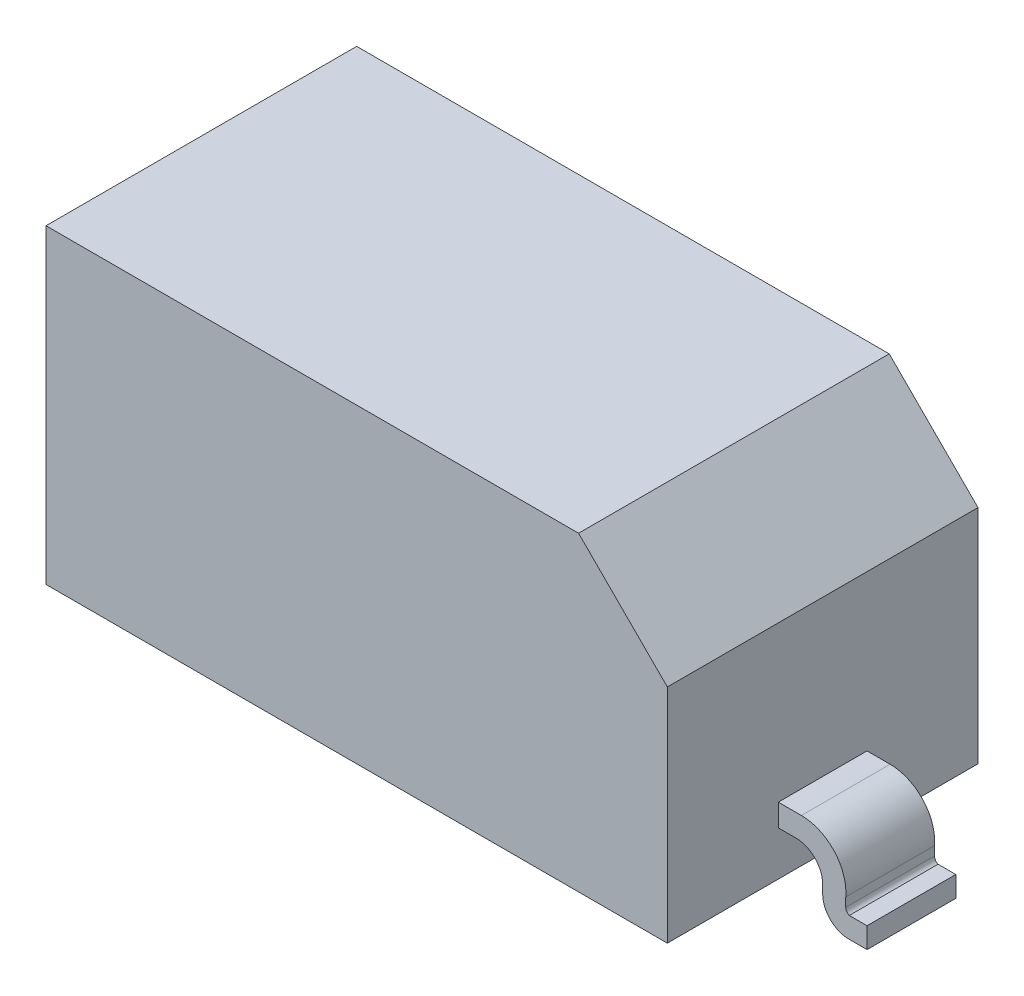
ISO-10303-21;
HEADER;
FILE_DESCRIPTION(('STEP AP214'),'2;1');
FILE_NAME('part.step','',(''),(''),'','','');
FILE_SCHEMA(('AUTOMOTIVE_DESIGN { 1 0 10303 214 1 1 1 1 }'));
ENDSEC;
DATA;
#1=APPLICATION_CONTEXT('core data for automotive mechanical design processes');
#2=APPLICATION_PROTOCOL_DEFINITION('international standard','automotive_design',2000,#1);
#3=PRODUCT_CONTEXT('',#1,'mechanical');
#4=PRODUCT('Part','Part','',(#3));
#5=PRODUCT_RELATED_PRODUCT_CATEGORY('part','',(#4));
#6=PRODUCT_DEFINITION_FORMATION('','',#4);
#7=PRODUCT_DEFINITION_CONTEXT('part definition',#1,'design');
#8=PRODUCT_DEFINITION('design','',#6,#7);
#9=PRODUCT_DEFINITION_SHAPE('','',#8);
#10=(LENGTH_UNIT() NAMED_UNIT(*) SI_UNIT(.MILLI.,.METRE.));
#11=(NAMED_UNIT(*) PLANE_ANGLE_UNIT() SI_UNIT($,.RADIAN.));
#12=(NAMED_UNIT(*) SI_UNIT($,.STERADIAN.) SOLID_ANGLE_UNIT());
#13=UNCERTAINTY_MEASURE_WITH_UNIT(LENGTH_MEASURE(1.E-05),#10,'distance_accuracy_value','');
#14=(GEOMETRIC_REPRESENTATION_CONTEXT(3) GLOBAL_UNCERTAINTY_ASSIGNED_CONTEXT((#13)) GLOBAL_UNIT_ASSIGNED_CONTEXT((#10,
#11,#12)) REPRESENTATION_CONTEXT('',''));
#15=CARTESIAN_POINT('',(0.,0.,0.));
#16=DIRECTION('',(0.,0.,1.));
#17=DIRECTION('',(1.,0.,0.));
#18=AXIS2_PLACEMENT_3D('',#15,#16,#17);
#19=CARTESIAN_POINT('',(-1.75,0.875,0.875));
#20=DIRECTION('',(1.,0.,0.));
#21=DIRECTION('',(0.,0.,-1.));
#22=AXIS2_PLACEMENT_3D('',#19,#20,#21);
#23=PLANE('',#22);
#24=DIRECTION('',(0.,-1.,0.));
#25=VECTOR('',#24,1.);
#26=CARTESIAN_POINT('',(-1.75,0.875,-0.875));
#27=LINE('',#26,#25);
#28=CARTESIAN_POINT('',(-1.75,0.875,-0.875));
#29=VERTEX_POINT('',#28);
#30=CARTESIAN_POINT('',(-1.75,-0.875,-0.875));
#31=VERTEX_POINT('',#30);
#32=EDGE_CURVE('E336',#29,#31,#27,.T.);
#33=ORIENTED_EDGE('',*,*,#32,.T.);
#34=DIRECTION('',(0.,0.,-1.));
#35=VECTOR('',#34,1.);
#36=CARTESIAN_POINT('',(-1.75,-0.875,0.875));
#37=LINE('',#36,#35);
#38=CARTESIAN_POINT('',(-1.75,-0.875,0.875));
#39=VERTEX_POINT('',#38);
#40=EDGE_CURVE('E11',#39,#31,#37,.T.);
#41=ORIENTED_EDGE('',*,*,#40,.F.);
#42=DIRECTION('',(0.,-1.,0.));
#43=VECTOR('',#42,1.);
#44=CARTESIAN_POINT('',(-1.75,0.875,0.875));
#45=LINE('',#44,#43);
#46=CARTESIAN_POINT('',(-1.75,0.875,0.875));
#47=VERTEX_POINT('',#46);
#48=EDGE_CURVE('E337',#47,#39,#45,.T.);
#49=ORIENTED_EDGE('',*,*,#48,.F.);
#50=DIRECTION('',(0.,0.,-1.));
#51=VECTOR('',#50,1.);
#52=CARTESIAN_POINT('',(-1.75,0.875,0.875));
#53=LINE('',#52,#51);
#54=EDGE_CURVE('E349',#47,#29,#53,.T.);
#55=ORIENTED_EDGE('',*,*,#54,.T.);
#56=EDGE_LOOP('',(#33,#41,#49,#55));
#57=FACE_BOUND('',#56,.T.);
#58=DIRECTION('',(0.,-1.,0.));
#59=VECTOR('',#58,1.);
#60=CARTESIAN_POINT('',(-1.75,-0.625,0.25));
#61=LINE('',#60,#59);
#62=CARTESIAN_POINT('',(-1.75,-0.49948491419278,0.25));
#63=VERTEX_POINT('',#62);
#64=CARTESIAN_POINT('',(-1.75,-0.625,0.25));
#65=VERTEX_POINT('',#64);
#66=EDGE_CURVE('E225',#63,#65,#61,.T.);
#67=ORIENTED_EDGE('',*,*,#66,.T.);
#68=DIRECTION('',(0.,0.,-1.));
#69=VECTOR('',#68,1.);
#70=CARTESIAN_POINT('',(-1.75,-0.625,0.25));
#71=LINE('',#70,#69);
#72=CARTESIAN_POINT('',(-1.75,-0.625,-0.25));
#73=VERTEX_POINT('',#72);
#74=EDGE_CURVE('E706',#65,#73,#71,.T.);
#75=ORIENTED_EDGE('',*,*,#74,.T.);
#76=DIRECTION('',(0.,-1.,0.));
#77=VECTOR('',#76,1.);
#78=CARTESIAN_POINT('',(-1.75,-0.625,-0.25));
#79=LINE('',#78,#77);
#80=CARTESIAN_POINT('',(-1.75,-0.499484914192779,-0.25));
#81=VERTEX_POINT('',#80);
#82=EDGE_CURVE('E246',#81,#73,#79,.T.);
#83=ORIENTED_EDGE('',*,*,#82,.F.);
#84=DIRECTION('',(0.,0.,-1.));
#85=VECTOR('',#84,1.);
#86=CARTESIAN_POINT('',(-1.75,-0.49948491419278,0.25));
#87=LINE('',#86,#85);
#88=EDGE_CURVE('E241',#63,#81,#87,.T.);
#89=ORIENTED_EDGE('',*,*,#88,.F.);
#90=EDGE_LOOP('',(#67,#75,#83,#89));
#91=FACE_BOUND('',#90,.T.);
#92=ADVANCED_FACE('F33',(#57,#91),#23,.F.);
#93=CARTESIAN_POINT('',(1.75,-0.874999999999999,0.875));
#94=DIRECTION('',(-1.,0.,0.));
#95=DIRECTION('',(0.,-1.,0.));
#96=AXIS2_PLACEMENT_3D('',#93,#94,#95);
#97=PLANE('',#96);
#98=DIRECTION('',(0.,1.,0.));
#99=VECTOR('',#98,1.);
#100=CARTESIAN_POINT('',(1.75,-0.874999999999999,-0.875));
#101=LINE('',#100,#99);
#102=CARTESIAN_POINT('',(1.75,-0.874999999999999,-0.875));
#103=VERTEX_POINT('',#102);
#104=CARTESIAN_POINT('',(1.75,0.375000000000001,-0.875));
#105=VERTEX_POINT('',#104);
#106=EDGE_CURVE('E354',#103,#105,#101,.T.);
#107=ORIENTED_EDGE('',*,*,#106,.T.);
#108=DIRECTION('',(0.,0.,-1.));
#109=VECTOR('',#108,1.);
#110=CARTESIAN_POINT('',(1.75,0.375000000000001,0.875));
#111=LINE('',#110,#109);
#112=CARTESIAN_POINT('',(1.75,0.375000000000001,0.875));
#113=VERTEX_POINT('',#112);
#114=EDGE_CURVE('E364',#113,#105,#111,.T.);
#115=ORIENTED_EDGE('',*,*,#114,.F.);
#116=DIRECTION('',(0.,1.,0.));
#117=VECTOR('',#116,1.);
#118=CARTESIAN_POINT('',(1.75,-0.874999999999999,0.875));
#119=LINE('',#118,#117);
#120=CARTESIAN_POINT('',(1.75,-0.874999999999999,0.875));
#121=VERTEX_POINT('',#120);
#122=EDGE_CURVE('E343',#121,#113,#119,.T.);
#123=ORIENTED_EDGE('',*,*,#122,.F.);
#124=DIRECTION('',(0.,0.,-1.));
#125=VECTOR('',#124,1.);
#126=CARTESIAN_POINT('',(1.75,-0.874999999999999,0.875));
#127=LINE('',#126,#125);
#128=EDGE_CURVE('E40',#121,#103,#127,.T.);
#129=ORIENTED_EDGE('',*,*,#128,.T.);
#130=EDGE_LOOP('',(#107,#115,#123,#129));
#131=FACE_BOUND('',#130,.T.);
#132=DIRECTION('',(0.,-1.,0.));
#133=VECTOR('',#132,1.);
#134=CARTESIAN_POINT('',(1.75,-0.625,0.25));
#135=LINE('',#134,#133);
#136=CARTESIAN_POINT('',(1.75,-0.49948491419278,0.25));
#137=VERTEX_POINT('',#136);
#138=CARTESIAN_POINT('',(1.75,-0.625,0.25));
#139=VERTEX_POINT('',#138);
#140=EDGE_CURVE('E256',#137,#139,#135,.T.);
#141=ORIENTED_EDGE('',*,*,#140,.F.);
#142=DIRECTION('',(0.,0.,-1.));
#143=VECTOR('',#142,1.);
#144=CARTESIAN_POINT('',(1.75,-0.49948491419278,0.25));
#145=LINE('',#144,#143);
#146=CARTESIAN_POINT('',(1.75,-0.49948491419278,-0.25));
#147=VERTEX_POINT('',#146);
#148=EDGE_CURVE('E281',#137,#147,#145,.T.);
#149=ORIENTED_EDGE('',*,*,#148,.T.);
#150=DIRECTION('',(0.,-1.,0.));
#151=VECTOR('',#150,1.);
#152=CARTESIAN_POINT('',(1.75,-0.625,-0.25));
#153=LINE('',#152,#151);
#154=CARTESIAN_POINT('',(1.75,-0.625,-0.25));
#155=VERTEX_POINT('',#154);
#156=EDGE_CURVE('E247',#147,#155,#153,.T.);
#157=ORIENTED_EDGE('',*,*,#156,.T.);
#158=DIRECTION('',(0.,0.,-1.));
#159=VECTOR('',#158,1.);
#160=CARTESIAN_POINT('',(1.75,-0.625,0.25));
#161=LINE('',#160,#159);
#162=EDGE_CURVE('E55',#139,#155,#161,.T.);
#163=ORIENTED_EDGE('',*,*,#162,.F.);
#164=EDGE_LOOP('',(#141,#149,#157,#163));
#165=FACE_BOUND('',#164,.T.);
#166=ADVANCED_FACE('F371',(#131,#165),#97,.F.);
#167=CARTESIAN_POINT('',(-1.75,-0.875,0.875));
#168=DIRECTION('',(0.,1.,0.));
#169=DIRECTION('',(-1.,0.,0.));
#170=AXIS2_PLACEMENT_3D('',#167,#168,#169);
#171=PLANE('',#170);
#172=DIRECTION('',(1.,0.,0.));
#173=VECTOR('',#172,1.);
#174=CARTESIAN_POINT('',(-1.75,-0.875,-0.875));
#175=LINE('',#174,#173);
#176=EDGE_CURVE('E352',#31,#103,#175,.T.);
#177=ORIENTED_EDGE('',*,*,#176,.T.);
#178=ORIENTED_EDGE('',*,*,#128,.F.);
#179=DIRECTION('',(1.,0.,0.));
#180=VECTOR('',#179,1.);
#181=CARTESIAN_POINT('',(-1.75,-0.875,0.875));
#182=LINE('',#181,#180);
#183=EDGE_CURVE('E340',#39,#121,#182,.T.);
#184=ORIENTED_EDGE('',*,*,#183,.F.);
#185=ORIENTED_EDGE('',*,*,#40,.T.);
#186=EDGE_LOOP('',(#177,#178,#184,#185));
#187=FACE_BOUND('',#186,.T.);
#188=ADVANCED_FACE('F392',(#187),#171,.F.);
#189=CARTESIAN_POINT('',(1.75,0.375000000000001,0.875));
#190=DIRECTION('',(-0.707106781186548,-0.707106781186547,0.));
#191=DIRECTION('',(0.707106781186547,-0.707106781186548,0.));
#192=AXIS2_PLACEMENT_3D('',#189,#190,#191);
#193=PLANE('',#192);
#194=DIRECTION('',(-0.707106781186547,0.707106781186548,0.));
#195=VECTOR('',#194,1.);
#196=CARTESIAN_POINT('',(1.75,0.375000000000001,-0.875));
#197=LINE('',#196,#195);
#198=CARTESIAN_POINT('',(1.25,0.875,-0.875));
#199=VERTEX_POINT('',#198);
#200=EDGE_CURVE('E356',#105,#199,#197,.T.);
#201=ORIENTED_EDGE('',*,*,#200,.T.);
#202=DIRECTION('',(0.,0.,-1.));
#203=VECTOR('',#202,1.);
#204=CARTESIAN_POINT('',(1.25,0.875,0.875));
#205=LINE('',#204,#203);
#206=CARTESIAN_POINT('',(1.25,0.875,0.875));
#207=VERTEX_POINT('',#206);
#208=EDGE_CURVE('E361',#207,#199,#205,.T.);
#209=ORIENTED_EDGE('',*,*,#208,.F.);
#210=DIRECTION('',(-0.707106781186547,0.707106781186548,0.));
#211=VECTOR('',#210,1.);
#212=CARTESIAN_POINT('',(1.75,0.375000000000001,0.875));
#213=LINE('',#212,#211);
#214=EDGE_CURVE('E345',#113,#207,#213,.T.);
#215=ORIENTED_EDGE('',*,*,#214,.F.);
#216=ORIENTED_EDGE('',*,*,#114,.T.);
#217=EDGE_LOOP('',(#201,#209,#215,#216));
#218=FACE_BOUND('',#217,.T.);
#219=ADVANCED_FACE('F382',(#218),#193,.F.);
#220=CARTESIAN_POINT('',(1.25,0.875,0.875));
#221=DIRECTION('',(0.,-1.,0.));
#222=DIRECTION('',(0.,0.,-1.));
#223=AXIS2_PLACEMENT_3D('',#220,#221,#222);
#224=PLANE('',#223);
#225=DIRECTION('',(-1.,0.,0.));
#226=VECTOR('',#225,1.);
#227=CARTESIAN_POINT('',(1.25,0.875,-0.875));
#228=LINE('',#227,#226);
#229=EDGE_CURVE('E341',#199,#29,#228,.T.);
#230=ORIENTED_EDGE('',*,*,#229,.T.);
#231=ORIENTED_EDGE('',*,*,#54,.F.);
#232=DIRECTION('',(-1.,0.,0.));
#233=VECTOR('',#232,1.);
#234=CARTESIAN_POINT('',(1.25,0.875,0.875));
#235=LINE('',#234,#233);
#236=EDGE_CURVE('E347',#207,#47,#235,.T.);
#237=ORIENTED_EDGE('',*,*,#236,.F.);
#238=ORIENTED_EDGE('',*,*,#208,.T.);
#239=EDGE_LOOP('',(#230,#231,#237,#238));
#240=FACE_BOUND('',#239,.T.);
#241=ADVANCED_FACE('F386',(#240),#224,.F.);
#242=CARTESIAN_POINT('',(-1.75,0.875,0.875));
#243=DIRECTION('',(0.,0.,-1.));
#244=DIRECTION('',(-1.,0.,0.));
#245=AXIS2_PLACEMENT_3D('',#242,#243,#244);
#246=PLANE('',#245);
#247=ORIENTED_EDGE('',*,*,#48,.T.);
#248=ORIENTED_EDGE('',*,*,#183,.T.);
#249=ORIENTED_EDGE('',*,*,#122,.T.);
#250=ORIENTED_EDGE('',*,*,#214,.T.);
#251=ORIENTED_EDGE('',*,*,#236,.T.);
#252=EDGE_LOOP('',(#247,#248,#249,#250,#251));
#253=FACE_BOUND('',#252,.T.);
#254=ADVANCED_FACE('F390',(#253),#246,.F.);
#255=CARTESIAN_POINT('',(-1.75,0.875,-0.875));
#256=DIRECTION('',(0.,0.,-1.));
#257=DIRECTION('',(-1.,0.,0.));
#258=AXIS2_PLACEMENT_3D('',#255,#256,#257);
#259=PLANE('',#258);
#260=ORIENTED_EDGE('',*,*,#32,.F.);
#261=ORIENTED_EDGE('',*,*,#229,.F.);
#262=ORIENTED_EDGE('',*,*,#200,.F.);
#263=ORIENTED_EDGE('',*,*,#106,.F.);
#264=ORIENTED_EDGE('',*,*,#176,.F.);
#265=EDGE_LOOP('',(#260,#261,#262,#263,#264));
#266=FACE_BOUND('',#265,.T.);
#267=ADVANCED_FACE('F378',(#266),#259,.T.);
#268=CARTESIAN_POINT('',(1.75,-0.625,0.25));
#269=DIRECTION('',(0.,1.,0.));
#270=DIRECTION('',(0.,0.,1.));
#271=AXIS2_PLACEMENT_3D('',#268,#269,#270);
#272=PLANE('',#271);
#273=DIRECTION('',(1.,0.,0.));
#274=VECTOR('',#273,1.);
#275=CARTESIAN_POINT('',(1.75,-0.625,-0.25));
#276=LINE('',#275,#274);
#277=CARTESIAN_POINT('',(1.85,-0.625,-0.25));
#278=VERTEX_POINT('',#277);
#279=EDGE_CURVE('E250',#155,#278,#276,.T.);
#280=ORIENTED_EDGE('',*,*,#279,.T.);
#281=DIRECTION('',(0.,0.,-1.));
#282=VECTOR('',#281,1.);
#283=CARTESIAN_POINT('',(1.85,-0.625,0.25));
#284=LINE('',#283,#282);
#285=CARTESIAN_POINT('',(1.85,-0.625,0.25));
#286=VERTEX_POINT('',#285);
#287=EDGE_CURVE('E332',#286,#278,#284,.T.);
#288=ORIENTED_EDGE('',*,*,#287,.F.);
#289=DIRECTION('',(1.,0.,0.));
#290=VECTOR('',#289,1.);
#291=CARTESIAN_POINT('',(1.75,-0.625,0.25));
#292=LINE('',#291,#290);
#293=EDGE_CURVE('E259',#139,#286,#292,.T.);
#294=ORIENTED_EDGE('',*,*,#293,.F.);
#295=ORIENTED_EDGE('',*,*,#162,.T.);
#296=EDGE_LOOP('',(#280,#288,#294,#295));
#297=FACE_BOUND('',#296,.T.);
#298=ADVANCED_FACE('F409',(#297),#272,.F.);
#299=CARTESIAN_POINT('',(1.85,-0.77503124674547,0.25));
#300=DIRECTION('',(0.,0.,-1.));
#301=DIRECTION('',(-1.,0.,0.));
#302=AXIS2_PLACEMENT_3D('',#299,#300,#301);
#303=CYLINDRICAL_SURFACE('',#302,0.15003124674547);
#304=CARTESIAN_POINT('',(1.85,-0.77503124674547,-0.25));
#305=DIRECTION('',(0.,0.,-1.));
#306=DIRECTION('',(-1.,0.,0.));
#307=AXIS2_PLACEMENT_3D('',#304,#305,#306);
#308=CIRCLE('',#307,0.15003124674547);
#309=CARTESIAN_POINT('',(2.,-0.771969384566991,-0.25));
#310=VERTEX_POINT('',#309);
#311=EDGE_CURVE('E284',#278,#310,#308,.T.);
#312=ORIENTED_EDGE('',*,*,#311,.T.);
#313=DIRECTION('',(0.,0.,-1.));
#314=VECTOR('',#313,1.);
#315=CARTESIAN_POINT('',(2.,-0.771969384566991,0.25));
#316=LINE('',#315,#314);
#317=CARTESIAN_POINT('',(2.,-0.771969384566991,0.25));
#318=VERTEX_POINT('',#317);
#319=EDGE_CURVE('E329',#318,#310,#316,.T.);
#320=ORIENTED_EDGE('',*,*,#319,.F.);
#321=CARTESIAN_POINT('',(1.85,-0.77503124674547,0.25));
#322=DIRECTION('',(0.,0.,-1.));
#323=DIRECTION('',(-1.,0.,0.));
#324=AXIS2_PLACEMENT_3D('',#321,#322,#323);
#325=CIRCLE('',#324,0.15003124674547);
#326=EDGE_CURVE('E262',#286,#318,#325,.T.);
#327=ORIENTED_EDGE('',*,*,#326,.F.);
#328=ORIENTED_EDGE('',*,*,#287,.T.);
#329=EDGE_LOOP('',(#312,#320,#327,#328));
#330=FACE_BOUND('',#329,.T.);
#331=ADVANCED_FACE('F414',(#330),#303,.F.);
#332=CARTESIAN_POINT('',(2.,-0.771969384566991,0.25));
#333=DIRECTION('',(1.,0.,0.));
#334=DIRECTION('',(0.,0.,-1.));
#335=AXIS2_PLACEMENT_3D('',#332,#333,#334);
#336=PLANE('',#335);
#337=DIRECTION('',(0.,-1.,0.));
#338=VECTOR('',#337,1.);
#339=CARTESIAN_POINT('',(2.,-0.771969384566991,-0.25));
#340=LINE('',#339,#338);
#341=CARTESIAN_POINT('',(2.,-0.821969384566991,-0.25));
#342=VERTEX_POINT('',#341);
#343=EDGE_CURVE('E286',#310,#342,#340,.T.);
#344=ORIENTED_EDGE('',*,*,#343,.T.);
#345=DIRECTION('',(0.,0.,-1.));
#346=VECTOR('',#345,1.);
#347=CARTESIAN_POINT('',(2.,-0.821969384566991,0.25));
#348=LINE('',#347,#346);
#349=CARTESIAN_POINT('',(2.,-0.821969384566991,0.25));
#350=VERTEX_POINT('',#349);
#351=EDGE_CURVE('E326',#350,#342,#348,.T.);
#352=ORIENTED_EDGE('',*,*,#351,.F.);
#353=DIRECTION('',(0.,-1.,0.));
#354=VECTOR('',#353,1.);
#355=CARTESIAN_POINT('',(2.,-0.771969384566991,0.25));
#356=LINE('',#355,#354);
#357=EDGE_CURVE('E264',#318,#350,#356,.T.);
#358=ORIENTED_EDGE('',*,*,#357,.F.);
#359=ORIENTED_EDGE('',*,*,#319,.T.);
#360=EDGE_LOOP('',(#344,#352,#358,#359));
#361=FACE_BOUND('',#360,.T.);
#362=ADVANCED_FACE('F417',(#361),#336,.F.);
#363=CARTESIAN_POINT('',(2.147,-0.821969384566991,0.25));
#364=DIRECTION('',(0.,0.,-1.));
#365=DIRECTION('',(-1.,0.,0.));
#366=AXIS2_PLACEMENT_3D('',#363,#364,#365);
#367=CYLINDRICAL_SURFACE('',#366,0.147);
#368=CARTESIAN_POINT('',(2.147,-0.821969384566991,-0.25));
#369=DIRECTION('',(0.,0.,1.));
#370=DIRECTION('',(1.,0.,0.));
#371=AXIS2_PLACEMENT_3D('',#368,#369,#370);
#372=CIRCLE('',#371,0.147);
#373=CARTESIAN_POINT('',(2.15,-0.968938769133981,-0.25));
#374=VERTEX_POINT('',#373);
#375=EDGE_CURVE('E288',#342,#374,#372,.T.);
#376=ORIENTED_EDGE('',*,*,#375,.T.);
#377=DIRECTION('',(0.,0.,-1.));
#378=VECTOR('',#377,1.);
#379=CARTESIAN_POINT('',(2.15,-0.968938769133981,0.25));
#380=LINE('',#379,#378);
#381=CARTESIAN_POINT('',(2.15,-0.968938769133981,0.25));
#382=VERTEX_POINT('',#381);
#383=EDGE_CURVE('E323',#382,#374,#380,.T.);
#384=ORIENTED_EDGE('',*,*,#383,.F.);
#385=CARTESIAN_POINT('',(2.147,-0.821969384566991,0.25));
#386=DIRECTION('',(0.,0.,1.));
#387=DIRECTION('',(1.,0.,0.));
#388=AXIS2_PLACEMENT_3D('',#385,#386,#387);
#389=CIRCLE('',#388,0.147);
#390=EDGE_CURVE('E266',#350,#382,#389,.T.);
#391=ORIENTED_EDGE('',*,*,#390,.F.);
#392=ORIENTED_EDGE('',*,*,#351,.T.);
#393=EDGE_LOOP('',(#376,#384,#391,#392));
#394=FACE_BOUND('',#393,.T.);
#395=ADVANCED_FACE('F421',(#394),#367,.T.);
#396=CARTESIAN_POINT('',(2.25,-0.968938769133981,0.25));
#397=DIRECTION('',(0.,1.,0.));
#398=DIRECTION('',(0.,0.,1.));
#399=AXIS2_PLACEMENT_3D('',#396,#397,#398);
#400=PLANE('',#399);
#401=DIRECTION('',(1.,0.,0.));
#402=VECTOR('',#401,1.);
#403=CARTESIAN_POINT('',(2.25,-0.968938769133981,-0.25));
#404=LINE('',#403,#402);
#405=CARTESIAN_POINT('',(2.25,-0.968938769133981,-0.25));
#406=VERTEX_POINT('',#405);
#407=EDGE_CURVE('E290',#374,#406,#404,.T.);
#408=ORIENTED_EDGE('',*,*,#407,.T.);
#409=DIRECTION('',(0.,0.,-1.));
#410=VECTOR('',#409,1.);
#411=CARTESIAN_POINT('',(2.25,-0.968938769133981,0.25));
#412=LINE('',#411,#410);
#413=CARTESIAN_POINT('',(2.25,-0.968938769133981,0.25));
#414=VERTEX_POINT('',#413);
#415=EDGE_CURVE('E320',#414,#406,#412,.T.);
#416=ORIENTED_EDGE('',*,*,#415,.F.);
#417=DIRECTION('',(1.,0.,0.));
#418=VECTOR('',#417,1.);
#419=CARTESIAN_POINT('',(2.25,-0.968938769133981,0.25));
#420=LINE('',#419,#418);
#421=EDGE_CURVE('E268',#382,#414,#420,.T.);
#422=ORIENTED_EDGE('',*,*,#421,.F.);
#423=ORIENTED_EDGE('',*,*,#383,.T.);
#424=EDGE_LOOP('',(#408,#416,#422,#423));
#425=FACE_BOUND('',#424,.T.);
#426=ADVANCED_FACE('F425',(#425),#400,.F.);
#427=CARTESIAN_POINT('',(2.25,-0.852248548132497,0.25));
#428=DIRECTION('',(-1.,0.,0.));
#429=DIRECTION('',(0.,0.,1.));
#430=AXIS2_PLACEMENT_3D('',#427,#428,#429);
#431=PLANE('',#430);
#432=DIRECTION('',(0.,1.,0.));
#433=VECTOR('',#432,1.);
#434=CARTESIAN_POINT('',(2.25,-0.852248548132497,-0.25));
#435=LINE('',#434,#433);
#436=CARTESIAN_POINT('',(2.25,-0.852248548132497,-0.25));
#437=VERTEX_POINT('',#436);
#438=EDGE_CURVE('E292',#406,#437,#435,.T.);
#439=ORIENTED_EDGE('',*,*,#438,.T.);
#440=DIRECTION('',(0.,0.,-1.));
#441=VECTOR('',#440,1.);
#442=CARTESIAN_POINT('',(2.25,-0.852248548132497,0.25));
#443=LINE('',#442,#441);
#444=CARTESIAN_POINT('',(2.25,-0.852248548132497,0.25));
#445=VERTEX_POINT('',#444);
#446=EDGE_CURVE('E317',#445,#437,#443,.T.);
#447=ORIENTED_EDGE('',*,*,#446,.F.);
#448=DIRECTION('',(0.,1.,0.));
#449=VECTOR('',#448,1.);
#450=CARTESIAN_POINT('',(2.25,-0.852248548132497,0.25));
#451=LINE('',#450,#449);
#452=EDGE_CURVE('E270',#414,#445,#451,.T.);
#453=ORIENTED_EDGE('',*,*,#452,.F.);
#454=ORIENTED_EDGE('',*,*,#415,.T.);
#455=EDGE_LOOP('',(#439,#447,#453,#454));
#456=FACE_BOUND('',#455,.T.);
#457=ADVANCED_FACE('F429',(#456),#431,.F.);
#458=CARTESIAN_POINT('',(2.15,-0.852248548132497,0.25));
#459=DIRECTION('',(0.,-1.,0.));
#460=DIRECTION('',(0.,0.,-1.));
#461=AXIS2_PLACEMENT_3D('',#458,#459,#460);
#462=PLANE('',#461);
#463=DIRECTION('',(-1.,0.,0.));
#464=VECTOR('',#463,1.);
#465=CARTESIAN_POINT('',(2.15,-0.852248548132497,-0.25));
#466=LINE('',#465,#464);
#467=CARTESIAN_POINT('',(2.15,-0.852248548132497,-0.25));
#468=VERTEX_POINT('',#467);
#469=EDGE_CURVE('E294',#437,#468,#466,.T.);
#470=ORIENTED_EDGE('',*,*,#469,.T.);
#471=DIRECTION('',(0.,0.,-1.));
#472=VECTOR('',#471,1.);
#473=CARTESIAN_POINT('',(2.15,-0.852248548132497,0.25));
#474=LINE('',#473,#472);
#475=CARTESIAN_POINT('',(2.15,-0.852248548132497,0.25));
#476=VERTEX_POINT('',#475);
#477=EDGE_CURVE('E314',#476,#468,#474,.T.);
#478=ORIENTED_EDGE('',*,*,#477,.F.);
#479=DIRECTION('',(-1.,0.,0.));
#480=VECTOR('',#479,1.);
#481=CARTESIAN_POINT('',(2.15,-0.852248548132497,0.25));
#482=LINE('',#481,#480);
#483=EDGE_CURVE('E272',#445,#476,#482,.T.);
#484=ORIENTED_EDGE('',*,*,#483,.F.);
#485=ORIENTED_EDGE('',*,*,#446,.T.);
#486=EDGE_LOOP('',(#470,#478,#484,#485));
#487=FACE_BOUND('',#486,.T.);
#488=ADVANCED_FACE('F433',(#487),#462,.F.);
#489=CARTESIAN_POINT('',(2.1625,-0.822248548132497,0.25));
#490=DIRECTION('',(0.,0.,-1.));
#491=DIRECTION('',(-1.,0.,0.));
#492=AXIS2_PLACEMENT_3D('',#489,#490,#491);
#493=CYLINDRICAL_SURFACE('',#492,0.0324999999999995);
#494=CARTESIAN_POINT('',(2.1625,-0.822248548132497,-0.25));
#495=DIRECTION('',(0.,0.,-1.));
#496=DIRECTION('',(1.,0.,0.));
#497=AXIS2_PLACEMENT_3D('',#494,#495,#496);
#498=CIRCLE('',#497,0.0324999999999995);
#499=CARTESIAN_POINT('',(2.13,-0.822248548132497,-0.25));
#500=VERTEX_POINT('',#499);
#501=EDGE_CURVE('E296',#468,#500,#498,.T.);
#502=ORIENTED_EDGE('',*,*,#501,.T.);
#503=DIRECTION('',(0.,0.,-1.));
#504=VECTOR('',#503,1.);
#505=CARTESIAN_POINT('',(2.13,-0.822248548132497,0.25));
#506=LINE('',#505,#504);
#507=CARTESIAN_POINT('',(2.13,-0.822248548132497,0.25));
#508=VERTEX_POINT('',#507);
#509=EDGE_CURVE('E311',#508,#500,#506,.T.);
#510=ORIENTED_EDGE('',*,*,#509,.F.);
#511=CARTESIAN_POINT('',(2.1625,-0.822248548132497,0.25));
#512=DIRECTION('',(0.,0.,-1.));
#513=DIRECTION('',(1.,0.,0.));
#514=AXIS2_PLACEMENT_3D('',#511,#512,#513);
#515=CIRCLE('',#514,0.0324999999999995);
#516=EDGE_CURVE('E274',#476,#508,#515,.T.);
#517=ORIENTED_EDGE('',*,*,#516,.F.);
#518=ORIENTED_EDGE('',*,*,#477,.T.);
#519=EDGE_LOOP('',(#502,#510,#517,#518));
#520=FACE_BOUND('',#519,.T.);
#521=ADVANCED_FACE('F437',(#520),#493,.F.);
#522=CARTESIAN_POINT('',(2.13,-0.772248548132497,0.25));
#523=DIRECTION('',(-1.,0.,0.));
#524=DIRECTION('',(0.,0.,1.));
#525=AXIS2_PLACEMENT_3D('',#522,#523,#524);
#526=PLANE('',#525);
#527=DIRECTION('',(0.,1.,0.));
#528=VECTOR('',#527,1.);
#529=CARTESIAN_POINT('',(2.13,-0.772248548132497,-0.25));
#530=LINE('',#529,#528);
#531=CARTESIAN_POINT('',(2.13,-0.772248548132497,-0.25));
#532=VERTEX_POINT('',#531);
#533=EDGE_CURVE('E298',#500,#532,#530,.T.);
#534=ORIENTED_EDGE('',*,*,#533,.T.);
#535=DIRECTION('',(0.,0.,-1.));
#536=VECTOR('',#535,1.);
#537=CARTESIAN_POINT('',(2.13,-0.772248548132497,0.25));
#538=LINE('',#537,#536);
#539=CARTESIAN_POINT('',(2.13,-0.772248548132497,0.25));
#540=VERTEX_POINT('',#539);
#541=EDGE_CURVE('E308',#540,#532,#538,.T.);
#542=ORIENTED_EDGE('',*,*,#541,.F.);
#543=DIRECTION('',(0.,1.,0.));
#544=VECTOR('',#543,1.);
#545=CARTESIAN_POINT('',(2.13,-0.772248548132497,0.25));
#546=LINE('',#545,#544);
#547=EDGE_CURVE('E276',#508,#540,#546,.T.);
#548=ORIENTED_EDGE('',*,*,#547,.F.);
#549=ORIENTED_EDGE('',*,*,#509,.T.);
#550=EDGE_LOOP('',(#534,#542,#548,#549));
#551=FACE_BOUND('',#550,.T.);
#552=ADVANCED_FACE('F441',(#551),#526,.F.);
#553=CARTESIAN_POINT('',(1.88,-0.75043478977307,0.25));
#554=DIRECTION('',(0.,0.,-1.));
#555=DIRECTION('',(-1.,0.,0.));
#556=AXIS2_PLACEMENT_3D('',#553,#554,#555);
#557=CYLINDRICAL_SURFACE('',#556,0.250949875580291);
#558=CARTESIAN_POINT('',(1.88,-0.75043478977307,-0.25));
#559=DIRECTION('',(0.,0.,1.));
#560=DIRECTION('',(-1.,0.,0.));
#561=AXIS2_PLACEMENT_3D('',#558,#559,#560);
#562=CIRCLE('',#561,0.250949875580291);
#563=CARTESIAN_POINT('',(1.88,-0.49948491419278,-0.25));
#564=VERTEX_POINT('',#563);
#565=EDGE_CURVE('E300',#532,#564,#562,.T.);
#566=ORIENTED_EDGE('',*,*,#565,.T.);
#567=DIRECTION('',(0.,0.,-1.));
#568=VECTOR('',#567,1.);
#569=CARTESIAN_POINT('',(1.88,-0.49948491419278,0.25));
#570=LINE('',#569,#568);
#571=CARTESIAN_POINT('',(1.88,-0.49948491419278,0.25));
#572=VERTEX_POINT('',#571);
#573=EDGE_CURVE('E305',#572,#564,#570,.T.);
#574=ORIENTED_EDGE('',*,*,#573,.F.);
#575=CARTESIAN_POINT('',(1.88,-0.75043478977307,0.25));
#576=DIRECTION('',(0.,0.,1.));
#577=DIRECTION('',(-1.,0.,0.));
#578=AXIS2_PLACEMENT_3D('',#575,#576,#577);
#579=CIRCLE('',#578,0.250949875580291);
#580=EDGE_CURVE('E278',#540,#572,#579,.T.);
#581=ORIENTED_EDGE('',*,*,#580,.F.);
#582=ORIENTED_EDGE('',*,*,#541,.T.);
#583=EDGE_LOOP('',(#566,#574,#581,#582));
#584=FACE_BOUND('',#583,.T.);
#585=ADVANCED_FACE('F445',(#584),#557,.T.);
#586=CARTESIAN_POINT('',(1.75,-0.49948491419278,0.25));
#587=DIRECTION('',(0.,-1.,0.));
#588=DIRECTION('',(0.,0.,-1.));
#589=AXIS2_PLACEMENT_3D('',#586,#587,#588);
#590=PLANE('',#589);
#591=DIRECTION('',(-1.,0.,0.));
#592=VECTOR('',#591,1.);
#593=CARTESIAN_POINT('',(1.75,-0.49948491419278,-0.25));
#594=LINE('',#593,#592);
#595=EDGE_CURVE('E260',#564,#147,#594,.T.);
#596=ORIENTED_EDGE('',*,*,#595,.T.);
#597=ORIENTED_EDGE('',*,*,#148,.F.);
#598=DIRECTION('',(-1.,0.,0.));
#599=VECTOR('',#598,1.);
#600=CARTESIAN_POINT('',(1.75,-0.49948491419278,0.25));
#601=LINE('',#600,#599);
#602=EDGE_CURVE('E280',#572,#137,#601,.T.);
#603=ORIENTED_EDGE('',*,*,#602,.F.);
#604=ORIENTED_EDGE('',*,*,#573,.T.);
#605=EDGE_LOOP('',(#596,#597,#603,#604));
#606=FACE_BOUND('',#605,.T.);
#607=ADVANCED_FACE('F449',(#606),#590,.F.);
#608=CARTESIAN_POINT('',(1.88,-0.75043478977307,0.25));
#609=DIRECTION('',(0.,0.,-1.));
#610=DIRECTION('',(-1.,0.,0.));
#611=AXIS2_PLACEMENT_3D('',#608,#609,#610);
#612=PLANE('',#611);
#613=ORIENTED_EDGE('',*,*,#140,.T.);
#614=ORIENTED_EDGE('',*,*,#293,.T.);
#615=ORIENTED_EDGE('',*,*,#326,.T.);
#616=ORIENTED_EDGE('',*,*,#357,.T.);
#617=ORIENTED_EDGE('',*,*,#390,.T.);
#618=ORIENTED_EDGE('',*,*,#421,.T.);
#619=ORIENTED_EDGE('',*,*,#452,.T.);
#620=ORIENTED_EDGE('',*,*,#483,.T.);
#621=ORIENTED_EDGE('',*,*,#516,.T.);
#622=ORIENTED_EDGE('',*,*,#547,.T.);
#623=ORIENTED_EDGE('',*,*,#580,.T.);
#624=ORIENTED_EDGE('',*,*,#602,.T.);
#625=EDGE_LOOP('',(#613,#614,#615,#616,#617,#618,#619,#620,#621,#622,#623,#624));
#626=FACE_BOUND('',#625,.T.);
#627=ADVANCED_FACE('F453',(#626),#612,.F.);
#628=CARTESIAN_POINT('',(1.88,-0.75043478977307,-0.25));
#629=DIRECTION('',(0.,0.,-1.));
#630=DIRECTION('',(-1.,0.,0.));
#631=AXIS2_PLACEMENT_3D('',#628,#629,#630);
#632=PLANE('',#631);
#633=ORIENTED_EDGE('',*,*,#156,.F.);
#634=ORIENTED_EDGE('',*,*,#595,.F.);
#635=ORIENTED_EDGE('',*,*,#565,.F.);
#636=ORIENTED_EDGE('',*,*,#533,.F.);
#637=ORIENTED_EDGE('',*,*,#501,.F.);
#638=ORIENTED_EDGE('',*,*,#469,.F.);
#639=ORIENTED_EDGE('',*,*,#438,.F.);
#640=ORIENTED_EDGE('',*,*,#407,.F.);
#641=ORIENTED_EDGE('',*,*,#375,.F.);
#642=ORIENTED_EDGE('',*,*,#343,.F.);
#643=ORIENTED_EDGE('',*,*,#311,.F.);
#644=ORIENTED_EDGE('',*,*,#279,.F.);
#645=EDGE_LOOP('',(#633,#634,#635,#636,#637,#638,#639,#640,#641,#642,#643,#644));
#646=FACE_BOUND('',#645,.T.);
#647=ADVANCED_FACE('F455',(#646),#632,.T.);
#648=CARTESIAN_POINT('',(-1.75,-0.49948491419278,0.25));
#649=DIRECTION('',(0.,1.,0.));
#650=DIRECTION('',(0.,0.,1.));
#651=AXIS2_PLACEMENT_3D('',#648,#649,#650);
#652=PLANE('',#651);
#653=DIRECTION('',(1.,0.,0.));
#654=VECTOR('',#653,1.);
#655=CARTESIAN_POINT('',(-1.75,-0.49948491419278,-0.25));
#656=LINE('',#655,#654);
#657=CARTESIAN_POINT('',(-1.88,-0.49948491419278,-0.25));
#658=VERTEX_POINT('',#657);
#659=EDGE_CURVE('E47',#658,#81,#656,.T.);
#660=ORIENTED_EDGE('',*,*,#659,.F.);
#661=DIRECTION('',(0.,0.,-1.));
#662=VECTOR('',#661,1.);
#663=CARTESIAN_POINT('',(-1.88,-0.49948491419278,0.25));
#664=LINE('',#663,#662);
#665=CARTESIAN_POINT('',(-1.88,-0.49948491419278,0.25));
#666=VERTEX_POINT('',#665);
#667=EDGE_CURVE('E243',#666,#658,#664,.T.);
#668=ORIENTED_EDGE('',*,*,#667,.F.);
#669=DIRECTION('',(1.,0.,0.));
#670=VECTOR('',#669,1.);
#671=CARTESIAN_POINT('',(-1.75,-0.49948491419278,0.25));
#672=LINE('',#671,#670);
#673=EDGE_CURVE('E229',#666,#63,#672,.T.);
#674=ORIENTED_EDGE('',*,*,#673,.T.);
#675=ORIENTED_EDGE('',*,*,#88,.T.);
#676=EDGE_LOOP('',(#660,#668,#674,#675));
#677=FACE_BOUND('',#676,.T.);
#678=ADVANCED_FACE('F240',(#677),#652,.T.);
#679=CARTESIAN_POINT('',(-1.88,-0.75043478977307,0.25));
#680=DIRECTION('',(0.,0.,-1.));
#681=DIRECTION('',(-1.,0.,0.));
#682=AXIS2_PLACEMENT_3D('',#679,#680,#681);
#683=CYLINDRICAL_SURFACE('',#682,0.250949875580291);
#684=CARTESIAN_POINT('',(-1.88,-0.75043478977307,-0.25));
#685=DIRECTION('',(0.,0.,-1.));
#686=DIRECTION('',(1.,0.,0.));
#687=AXIS2_PLACEMENT_3D('',#684,#685,#686);
#688=CIRCLE('',#687,0.250949875580291);
#689=CARTESIAN_POINT('',(-2.13,-0.772248548132497,-0.25));
#690=VERTEX_POINT('',#689);
#691=EDGE_CURVE('E738',#690,#658,#688,.T.);
#692=ORIENTED_EDGE('',*,*,#691,.F.);
#693=DIRECTION('',(0.,0.,-1.));
#694=VECTOR('',#693,1.);
#695=CARTESIAN_POINT('',(-2.13,-0.772248548132497,0.25));
#696=LINE('',#695,#694);
#697=CARTESIAN_POINT('',(-2.13,-0.772248548132497,0.25));
#698=VERTEX_POINT('',#697);
#699=EDGE_CURVE('E252',#698,#690,#696,.T.);
#700=ORIENTED_EDGE('',*,*,#699,.F.);
#701=CARTESIAN_POINT('',(-1.88,-0.75043478977307,0.25));
#702=DIRECTION('',(0.,0.,-1.));
#703=DIRECTION('',(1.,0.,0.));
#704=AXIS2_PLACEMENT_3D('',#701,#702,#703);
#705=CIRCLE('',#704,0.250949875580291);
#706=EDGE_CURVE('E244',#698,#666,#705,.T.);
#707=ORIENTED_EDGE('',*,*,#706,.T.);
#708=ORIENTED_EDGE('',*,*,#667,.T.);
#709=EDGE_LOOP('',(#692,#700,#707,#708));
#710=FACE_BOUND('',#709,.T.);
#711=ADVANCED_FACE('F464',(#710),#683,.T.);
#712=CARTESIAN_POINT('',(-2.13,-0.772248548132497,0.25));
#713=DIRECTION('',(-1.,0.,0.));
#714=DIRECTION('',(0.,0.,1.));
#715=AXIS2_PLACEMENT_3D('',#712,#713,#714);
#716=PLANE('',#715);
#717=DIRECTION('',(0.,1.,0.));
#718=VECTOR('',#717,1.);
#719=CARTESIAN_POINT('',(-2.13,-0.772248548132497,-0.25));
#720=LINE('',#719,#718);
#721=CARTESIAN_POINT('',(-2.13,-0.822248548132497,-0.25));
#722=VERTEX_POINT('',#721);
#723=EDGE_CURVE('E734',#722,#690,#720,.T.);
#724=ORIENTED_EDGE('',*,*,#723,.F.);
#725=DIRECTION('',(0.,0.,-1.));
#726=VECTOR('',#725,1.);
#727=CARTESIAN_POINT('',(-2.13,-0.822248548132497,0.25));
#728=LINE('',#727,#726);
#729=CARTESIAN_POINT('',(-2.13,-0.822248548132497,0.25));
#730=VERTEX_POINT('',#729);
#731=EDGE_CURVE('E729',#730,#722,#728,.T.);
#732=ORIENTED_EDGE('',*,*,#731,.F.);
#733=DIRECTION('',(0.,1.,0.));
#734=VECTOR('',#733,1.);
#735=CARTESIAN_POINT('',(-2.13,-0.772248548132497,0.25));
#736=LINE('',#735,#734);
#737=EDGE_CURVE('E737',#730,#698,#736,.T.);
#738=ORIENTED_EDGE('',*,*,#737,.T.);
#739=ORIENTED_EDGE('',*,*,#699,.T.);
#740=EDGE_LOOP('',(#724,#732,#738,#739));
#741=FACE_BOUND('',#740,.T.);
#742=ADVANCED_FACE('F467',(#741),#716,.T.);
#743=CARTESIAN_POINT('',(-2.1625,-0.822248548132497,0.25));
#744=DIRECTION('',(0.,0.,-1.));
#745=DIRECTION('',(-1.,0.,0.));
#746=AXIS2_PLACEMENT_3D('',#743,#744,#745);
#747=CYLINDRICAL_SURFACE('',#746,0.0324999999999995);
#748=CARTESIAN_POINT('',(-2.1625,-0.822248548132497,-0.25));
#749=DIRECTION('',(0.,0.,1.));
#750=DIRECTION('',(-1.,0.,0.));
#751=AXIS2_PLACEMENT_3D('',#748,#749,#750);
#752=CIRCLE('',#751,0.0324999999999995);
#753=CARTESIAN_POINT('',(-2.15,-0.852248548132497,-0.25));
#754=VERTEX_POINT('',#753);
#755=EDGE_CURVE('E742',#754,#722,#752,.T.);
#756=ORIENTED_EDGE('',*,*,#755,.F.);
#757=DIRECTION('',(0.,0.,-1.));
#758=VECTOR('',#757,1.);
#759=CARTESIAN_POINT('',(-2.15,-0.852248548132497,0.25));
#760=LINE('',#759,#758);
#761=CARTESIAN_POINT('',(-2.15,-0.852248548132497,0.25));
#762=VERTEX_POINT('',#761);
#763=EDGE_CURVE('E727',#762,#754,#760,.T.);
#764=ORIENTED_EDGE('',*,*,#763,.F.);
#765=CARTESIAN_POINT('',(-2.1625,-0.822248548132497,0.25));
#766=DIRECTION('',(0.,0.,1.));
#767=DIRECTION('',(-1.,0.,0.));
#768=AXIS2_PLACEMENT_3D('',#765,#766,#767);
#769=CIRCLE('',#768,0.0324999999999995);
#770=EDGE_CURVE('E782',#762,#730,#769,.T.);
#771=ORIENTED_EDGE('',*,*,#770,.T.);
#772=ORIENTED_EDGE('',*,*,#731,.T.);
#773=EDGE_LOOP('',(#756,#764,#771,#772));
#774=FACE_BOUND('',#773,.T.);
#775=ADVANCED_FACE('F471',(#774),#747,.F.);
#776=CARTESIAN_POINT('',(-2.15,-0.852248548132497,0.25));
#777=DIRECTION('',(0.,1.,0.));
#778=DIRECTION('',(0.,0.,1.));
#779=AXIS2_PLACEMENT_3D('',#776,#777,#778);
#780=PLANE('',#779);
#781=DIRECTION('',(1.,0.,0.));
#782=VECTOR('',#781,1.);
#783=CARTESIAN_POINT('',(-2.15,-0.852248548132497,-0.25));
#784=LINE('',#783,#782);
#785=CARTESIAN_POINT('',(-2.25,-0.852248548132497,-0.25));
#786=VERTEX_POINT('',#785);
#787=EDGE_CURVE('E744',#786,#754,#784,.T.);
#788=ORIENTED_EDGE('',*,*,#787,.F.);
#789=DIRECTION('',(0.,0.,-1.));
#790=VECTOR('',#789,1.);
#791=CARTESIAN_POINT('',(-2.25,-0.852248548132497,0.25));
#792=LINE('',#791,#790);
#793=CARTESIAN_POINT('',(-2.25,-0.852248548132497,0.25));
#794=VERTEX_POINT('',#793);
#795=EDGE_CURVE('E725',#794,#786,#792,.T.);
#796=ORIENTED_EDGE('',*,*,#795,.F.);
#797=DIRECTION('',(1.,0.,0.));
#798=VECTOR('',#797,1.);
#799=CARTESIAN_POINT('',(-2.15,-0.852248548132497,0.25));
#800=LINE('',#799,#798);
#801=EDGE_CURVE('E779',#794,#762,#800,.T.);
#802=ORIENTED_EDGE('',*,*,#801,.T.);
#803=ORIENTED_EDGE('',*,*,#763,.T.);
#804=EDGE_LOOP('',(#788,#796,#802,#803));
#805=FACE_BOUND('',#804,.T.);
#806=ADVANCED_FACE('F475',(#805),#780,.T.);
#807=CARTESIAN_POINT('',(-2.25,-0.852248548132497,0.25));
#808=DIRECTION('',(-1.,0.,0.));
#809=DIRECTION('',(0.,0.,1.));
#810=AXIS2_PLACEMENT_3D('',#807,#808,#809);
#811=PLANE('',#810);
#812=DIRECTION('',(0.,1.,0.));
#813=VECTOR('',#812,1.);
#814=CARTESIAN_POINT('',(-2.25,-0.852248548132497,-0.25));
#815=LINE('',#814,#813);
#816=CARTESIAN_POINT('',(-2.25,-0.968938769133981,-0.25));
#817=VERTEX_POINT('',#816);
#818=EDGE_CURVE('E749',#817,#786,#815,.T.);
#819=ORIENTED_EDGE('',*,*,#818,.F.);
#820=DIRECTION('',(0.,0.,-1.));
#821=VECTOR('',#820,1.);
#822=CARTESIAN_POINT('',(-2.25,-0.968938769133981,0.25));
#823=LINE('',#822,#821);
#824=CARTESIAN_POINT('',(-2.25,-0.968938769133981,0.25));
#825=VERTEX_POINT('',#824);
#826=EDGE_CURVE('E723',#825,#817,#823,.T.);
#827=ORIENTED_EDGE('',*,*,#826,.F.);
#828=DIRECTION('',(0.,1.,0.));
#829=VECTOR('',#828,1.);
#830=CARTESIAN_POINT('',(-2.25,-0.852248548132497,0.25));
#831=LINE('',#830,#829);
#832=EDGE_CURVE('E776',#825,#794,#831,.T.);
#833=ORIENTED_EDGE('',*,*,#832,.T.);
#834=ORIENTED_EDGE('',*,*,#795,.T.);
#835=EDGE_LOOP('',(#819,#827,#833,#834));
#836=FACE_BOUND('',#835,.T.);
#837=ADVANCED_FACE('F479',(#836),#811,.T.);
#838=CARTESIAN_POINT('',(-2.25,-0.968938769133981,0.25));
#839=DIRECTION('',(0.,-1.,0.));
#840=DIRECTION('',(0.,0.,-1.));
#841=AXIS2_PLACEMENT_3D('',#838,#839,#840);
#842=PLANE('',#841);
#843=DIRECTION('',(-1.,0.,0.));
#844=VECTOR('',#843,1.);
#845=CARTESIAN_POINT('',(-2.25,-0.968938769133981,-0.25));
#846=LINE('',#845,#844);
#847=CARTESIAN_POINT('',(-2.15,-0.968938769133981,-0.25));
#848=VERTEX_POINT('',#847);
#849=EDGE_CURVE('E752',#848,#817,#846,.T.);
#850=ORIENTED_EDGE('',*,*,#849,.F.);
#851=DIRECTION('',(0.,0.,-1.));
#852=VECTOR('',#851,1.);
#853=CARTESIAN_POINT('',(-2.15,-0.968938769133981,0.25));
#854=LINE('',#853,#852);
#855=CARTESIAN_POINT('',(-2.15,-0.968938769133981,0.25));
#856=VERTEX_POINT('',#855);
#857=EDGE_CURVE('E721',#856,#848,#854,.T.);
#858=ORIENTED_EDGE('',*,*,#857,.F.);
#859=DIRECTION('',(-1.,0.,0.));
#860=VECTOR('',#859,1.);
#861=CARTESIAN_POINT('',(-2.25,-0.968938769133981,0.25));
#862=LINE('',#861,#860);
#863=EDGE_CURVE('E772',#856,#825,#862,.T.);
#864=ORIENTED_EDGE('',*,*,#863,.T.);
#865=ORIENTED_EDGE('',*,*,#826,.T.);
#866=EDGE_LOOP('',(#850,#858,#864,#865));
#867=FACE_BOUND('',#866,.T.);
#868=ADVANCED_FACE('F483',(#867),#842,.T.);
#869=CARTESIAN_POINT('',(-2.147,-0.821969384566991,0.25));
#870=DIRECTION('',(0.,0.,-1.));
#871=DIRECTION('',(-1.,0.,0.));
#872=AXIS2_PLACEMENT_3D('',#869,#870,#871);
#873=CYLINDRICAL_SURFACE('',#872,0.147);
#874=CARTESIAN_POINT('',(-2.147,-0.821969384566991,-0.25));
#875=DIRECTION('',(0.,0.,-1.));
#876=DIRECTION('',(-1.,0.,0.));
#877=AXIS2_PLACEMENT_3D('',#874,#875,#876);
#878=CIRCLE('',#877,0.147);
#879=CARTESIAN_POINT('',(-2.,-0.821969384566991,-0.25));
#880=VERTEX_POINT('',#879);
#881=EDGE_CURVE('E755',#880,#848,#878,.T.);
#882=ORIENTED_EDGE('',*,*,#881,.F.);
#883=DIRECTION('',(0.,0.,-1.));
#884=VECTOR('',#883,1.);
#885=CARTESIAN_POINT('',(-2.,-0.821969384566991,0.25));
#886=LINE('',#885,#884);
#887=CARTESIAN_POINT('',(-2.,-0.821969384566991,0.25));
#888=VERTEX_POINT('',#887);
#889=EDGE_CURVE('E719',#888,#880,#886,.T.);
#890=ORIENTED_EDGE('',*,*,#889,.F.);
#891=CARTESIAN_POINT('',(-2.147,-0.821969384566991,0.25));
#892=DIRECTION('',(0.,0.,-1.));
#893=DIRECTION('',(-1.,0.,0.));
#894=AXIS2_PLACEMENT_3D('',#891,#892,#893);
#895=CIRCLE('',#894,0.147);
#896=EDGE_CURVE('E790',#888,#856,#895,.T.);
#897=ORIENTED_EDGE('',*,*,#896,.T.);
#898=ORIENTED_EDGE('',*,*,#857,.T.);
#899=EDGE_LOOP('',(#882,#890,#897,#898));
#900=FACE_BOUND('',#899,.T.);
#901=ADVANCED_FACE('F487',(#900),#873,.T.);
#902=CARTESIAN_POINT('',(-2.,-0.771969384566991,0.25));
#903=DIRECTION('',(1.,0.,0.));
#904=DIRECTION('',(0.,0.,-1.));
#905=AXIS2_PLACEMENT_3D('',#902,#903,#904);
#906=PLANE('',#905);
#907=DIRECTION('',(0.,-1.,0.));
#908=VECTOR('',#907,1.);
#909=CARTESIAN_POINT('',(-2.,-0.771969384566991,-0.25));
#910=LINE('',#909,#908);
#911=CARTESIAN_POINT('',(-2.,-0.771969384566991,-0.25));
#912=VERTEX_POINT('',#911);
#913=EDGE_CURVE('E758',#912,#880,#910,.T.);
#914=ORIENTED_EDGE('',*,*,#913,.F.);
#915=DIRECTION('',(0.,0.,-1.));
#916=VECTOR('',#915,1.);
#917=CARTESIAN_POINT('',(-2.,-0.771969384566991,0.25));
#918=LINE('',#917,#916);
#919=CARTESIAN_POINT('',(-2.,-0.771969384566991,0.25));
#920=VERTEX_POINT('',#919);
#921=EDGE_CURVE('E712',#920,#912,#918,.T.);
#922=ORIENTED_EDGE('',*,*,#921,.F.);
#923=DIRECTION('',(0.,-1.,0.));
#924=VECTOR('',#923,1.);
#925=CARTESIAN_POINT('',(-2.,-0.771969384566991,0.25));
#926=LINE('',#925,#924);
#927=EDGE_CURVE('E765',#920,#888,#926,.T.);
#928=ORIENTED_EDGE('',*,*,#927,.T.);
#929=ORIENTED_EDGE('',*,*,#889,.T.);
#930=EDGE_LOOP('',(#914,#922,#928,#929));
#931=FACE_BOUND('',#930,.T.);
#932=ADVANCED_FACE('F491',(#931),#906,.T.);
#933=CARTESIAN_POINT('',(-1.85,-0.77503124674547,0.25));
#934=DIRECTION('',(0.,0.,-1.));
#935=DIRECTION('',(-1.,0.,0.));
#936=AXIS2_PLACEMENT_3D('',#933,#934,#935);
#937=CYLINDRICAL_SURFACE('',#936,0.15003124674547);
#938=CARTESIAN_POINT('',(-1.85,-0.77503124674547,-0.25));
#939=DIRECTION('',(0.,0.,1.));
#940=DIRECTION('',(1.,0.,0.));
#941=AXIS2_PLACEMENT_3D('',#938,#939,#940);
#942=CIRCLE('',#941,0.15003124674547);
#943=CARTESIAN_POINT('',(-1.85,-0.625,-0.25));
#944=VERTEX_POINT('',#943);
#945=EDGE_CURVE('E709',#944,#912,#942,.T.);
#946=ORIENTED_EDGE('',*,*,#945,.F.);
#947=DIRECTION('',(0.,0.,-1.));
#948=VECTOR('',#947,1.);
#949=CARTESIAN_POINT('',(-1.85,-0.625,0.25));
#950=LINE('',#949,#948);
#951=CARTESIAN_POINT('',(-1.85,-0.625,0.25));
#952=VERTEX_POINT('',#951);
#953=EDGE_CURVE('E707',#952,#944,#950,.T.);
#954=ORIENTED_EDGE('',*,*,#953,.F.);
#955=CARTESIAN_POINT('',(-1.85,-0.77503124674547,0.25));
#956=DIRECTION('',(0.,0.,1.));
#957=DIRECTION('',(1.,0.,0.));
#958=AXIS2_PLACEMENT_3D('',#955,#956,#957);
#959=CIRCLE('',#958,0.15003124674547);
#960=EDGE_CURVE('E714',#952,#920,#959,.T.);
#961=ORIENTED_EDGE('',*,*,#960,.T.);
#962=ORIENTED_EDGE('',*,*,#921,.T.);
#963=EDGE_LOOP('',(#946,#954,#961,#962));
#964=FACE_BOUND('',#963,.T.);
#965=ADVANCED_FACE('F495',(#964),#937,.F.);
#966=CARTESIAN_POINT('',(-1.75,-0.625,0.25));
#967=DIRECTION('',(0.,-1.,0.));
#968=DIRECTION('',(0.,0.,-1.));
#969=AXIS2_PLACEMENT_3D('',#966,#967,#968);
#970=PLANE('',#969);
#971=DIRECTION('',(-1.,0.,0.));
#972=VECTOR('',#971,1.);
#973=CARTESIAN_POINT('',(-1.75,-0.625,-0.25));
#974=LINE('',#973,#972);
#975=EDGE_CURVE('E237',#73,#944,#974,.T.);
#976=ORIENTED_EDGE('',*,*,#975,.F.);
#977=ORIENTED_EDGE('',*,*,#74,.F.);
#978=DIRECTION('',(-1.,0.,0.));
#979=VECTOR('',#978,1.);
#980=CARTESIAN_POINT('',(-1.75,-0.625,0.25));
#981=LINE('',#980,#979);
#982=EDGE_CURVE('E233',#65,#952,#981,.T.);
#983=ORIENTED_EDGE('',*,*,#982,.T.);
#984=ORIENTED_EDGE('',*,*,#953,.T.);
#985=EDGE_LOOP('',(#976,#977,#983,#984));
#986=FACE_BOUND('',#985,.T.);
#987=ADVANCED_FACE('F499',(#986),#970,.T.);
#988=CARTESIAN_POINT('',(-1.88,-0.75043478977307,0.25));
#989=DIRECTION('',(0.,0.,-1.));
#990=DIRECTION('',(1.,0.,0.));
#991=AXIS2_PLACEMENT_3D('',#988,#989,#990);
#992=PLANE('',#991);
#993=ORIENTED_EDGE('',*,*,#66,.F.);
#994=ORIENTED_EDGE('',*,*,#673,.F.);
#995=ORIENTED_EDGE('',*,*,#706,.F.);
#996=ORIENTED_EDGE('',*,*,#737,.F.);
#997=ORIENTED_EDGE('',*,*,#770,.F.);
#998=ORIENTED_EDGE('',*,*,#801,.F.);
#999=ORIENTED_EDGE('',*,*,#832,.F.);
#1000=ORIENTED_EDGE('',*,*,#863,.F.);
#1001=ORIENTED_EDGE('',*,*,#896,.F.);
#1002=ORIENTED_EDGE('',*,*,#927,.F.);
#1003=ORIENTED_EDGE('',*,*,#960,.F.);
#1004=ORIENTED_EDGE('',*,*,#982,.F.);
#1005=EDGE_LOOP('',(#993,#994,#995,#996,#997,#998,#999,#1000,#1001,#1002,#1003,#1004));
#1006=FACE_BOUND('',#1005,.T.);
#1007=ADVANCED_FACE('F227',(#1006),#992,.F.);
#1008=CARTESIAN_POINT('',(-1.88,-0.75043478977307,-0.25));
#1009=DIRECTION('',(0.,0.,-1.));
#1010=DIRECTION('',(1.,0.,0.));
#1011=AXIS2_PLACEMENT_3D('',#1008,#1009,#1010);
#1012=PLANE('',#1011);
#1013=ORIENTED_EDGE('',*,*,#82,.T.);
#1014=ORIENTED_EDGE('',*,*,#975,.T.);
#1015=ORIENTED_EDGE('',*,*,#945,.T.);
#1016=ORIENTED_EDGE('',*,*,#913,.T.);
#1017=ORIENTED_EDGE('',*,*,#881,.T.);
#1018=ORIENTED_EDGE('',*,*,#849,.T.);
#1019=ORIENTED_EDGE('',*,*,#818,.T.);
#1020=ORIENTED_EDGE('',*,*,#787,.T.);
#1021=ORIENTED_EDGE('',*,*,#755,.T.);
#1022=ORIENTED_EDGE('',*,*,#723,.T.);
#1023=ORIENTED_EDGE('',*,*,#691,.T.);
#1024=ORIENTED_EDGE('',*,*,#659,.T.);
#1025=EDGE_LOOP('',(#1013,#1014,#1015,#1016,#1017,#1018,#1019,#1020,#1021,#1022,#1023,#1024));
#1026=FACE_BOUND('',#1025,.T.);
#1027=ADVANCED_FACE('F504',(#1026),#1012,.T.);
#1028=CLOSED_SHELL('',(#92,#166,#188,#219,#241,#254,#267,#298,#331,#362,#395,#426,#457,#488,
#521,#552,#585,#607,#627,#647,#678,#711,#742,#775,#806,#837,#868,#901,#932,#965,#987,#1007,#1027));
#1029=MANIFOLD_SOLID_BREP('B2',#1028);
#1030=ADVANCED_BREP_SHAPE_REPRESENTATION('',(#18,#1029),#14);
#1031=SHAPE_DEFINITION_REPRESENTATION(#9,#1030);
ENDSEC;
END-ISO-10303-21;
